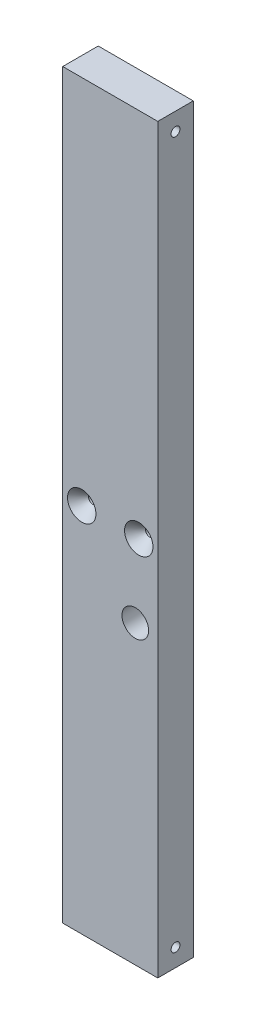
ISO-10303-21;
HEADER;
FILE_DESCRIPTION(('STEP AP214'),'2;1');
FILE_NAME('part.step','',(''),(''),'','','');
FILE_SCHEMA(('AUTOMOTIVE_DESIGN { 1 0 10303 214 1 1 1 1 }'));
ENDSEC;
DATA;
#1=APPLICATION_CONTEXT('core data for automotive mechanical design processes');
#2=APPLICATION_PROTOCOL_DEFINITION('international standard','automotive_design',2000,#1);
#3=PRODUCT_CONTEXT('',#1,'mechanical');
#4=PRODUCT('Part','Part','',(#3));
#5=PRODUCT_RELATED_PRODUCT_CATEGORY('part','',(#4));
#6=PRODUCT_DEFINITION_FORMATION('','',#4);
#7=PRODUCT_DEFINITION_CONTEXT('part definition',#1,'design');
#8=PRODUCT_DEFINITION('design','',#6,#7);
#9=PRODUCT_DEFINITION_SHAPE('','',#8);
#10=(LENGTH_UNIT() NAMED_UNIT(*) SI_UNIT(.MILLI.,.METRE.));
#11=(NAMED_UNIT(*) PLANE_ANGLE_UNIT() SI_UNIT($,.RADIAN.));
#12=(NAMED_UNIT(*) SI_UNIT($,.STERADIAN.) SOLID_ANGLE_UNIT());
#13=UNCERTAINTY_MEASURE_WITH_UNIT(LENGTH_MEASURE(1.E-05),#10,'distance_accuracy_value','');
#14=(GEOMETRIC_REPRESENTATION_CONTEXT(3) GLOBAL_UNCERTAINTY_ASSIGNED_CONTEXT((#13)) GLOBAL_UNIT_ASSIGNED_CONTEXT((#10,
#11,#12)) REPRESENTATION_CONTEXT('',''));
#15=CARTESIAN_POINT('',(0.,0.,0.));
#16=DIRECTION('',(0.,0.,1.));
#17=DIRECTION('',(1.,0.,0.));
#18=AXIS2_PLACEMENT_3D('',#15,#16,#17);
#19=CARTESIAN_POINT('',(-33.2809208496693,0.,2.22044604925031E-13));
#20=DIRECTION('',(0.,0.,1.00000000000004));
#21=DIRECTION('',(1.00000000000002,0.,0.));
#22=AXIS2_PLACEMENT_3D('',#19,#20,#21);
#23=CYLINDRICAL_SURFACE('',#22,1.5875);
#24=CARTESIAN_POINT('',(-33.2809208496694,0.,-4.01766166221915));
#25=DIRECTION('',(0.,0.,1.00000000000004));
#26=DIRECTION('',(1.00000000000002,0.,0.));
#27=AXIS2_PLACEMENT_3D('',#24,#25,#26);
#28=CIRCLE('',#27,1.58750000000001);
#29=CARTESIAN_POINT('',(-31.6934208496694,0.,-4.01766166221915));
#30=VERTEX_POINT('',#29);
#31=EDGE_CURVE('E143',#30,#30,#28,.T.);
#32=ORIENTED_EDGE('',*,*,#31,.T.);
#33=EDGE_LOOP('',(#32));
#34=FACE_BOUND('',#33,.T.);
#35=CARTESIAN_POINT('',(-33.2809208496706,0.,-6.3499999999998));
#36=DIRECTION('',(0.70710678118656,0.,0.707106781186575));
#37=DIRECTION('',(-0.707106781186559,0.,0.707106781186577));
#38=AXIS2_PLACEMENT_3D('',#35,#36,#37);
#39=ELLIPSE('',#38,2.24506403026729,1.5875);
#40=CARTESIAN_POINT('',(-33.28092084967,-1.58750000000005,-6.34999999999974));
#41=VERTEX_POINT('',#40);
#42=CARTESIAN_POINT('',(-33.280920849671,1.58749999999995,-6.34999999999986));
#43=VERTEX_POINT('',#42);
#44=EDGE_CURVE('E54',#41,#43,#39,.F.);
#45=ORIENTED_EDGE('',*,*,#44,.T.);
#46=CARTESIAN_POINT('',(-33.2809208496706,0.,-6.3499999999998));
#47=DIRECTION('',(-0.707106781186559,0.,0.707106781186577));
#48=DIRECTION('',(0.70710678118656,0.,0.707106781186575));
#49=AXIS2_PLACEMENT_3D('',#46,#47,#48);
#50=ELLIPSE('',#49,2.24506403026729,1.5875);
#51=EDGE_CURVE('E11',#43,#41,#50,.F.);
#52=ORIENTED_EDGE('',*,*,#51,.T.);
#53=EDGE_LOOP('',(#45,#52));
#54=FACE_BOUND('',#53,.T.);
#55=ADVANCED_FACE('F40',(#34,#54),#23,.F.);
#56=CARTESIAN_POINT('',(-40.0809208496699,-132.699999993998,-12.7));
#57=DIRECTION('',(-1.00000000000002,0.,0.));
#58=DIRECTION('',(0.,-1.,0.));
#59=AXIS2_PLACEMENT_3D('',#56,#57,#58);
#60=PLANE('',#59);
#61=CARTESIAN_POINT('',(-40.0809208496712,-94.5999999939987,-6.35000000000061));
#62=DIRECTION('',(-1.00000000000002,0.,0.));
#63=DIRECTION('',(0.,-1.,0.));
#64=AXIS2_PLACEMENT_3D('',#61,#62,#63);
#65=CIRCLE('',#64,1.5875);
#66=CARTESIAN_POINT('',(-40.0809208496712,-96.1874999939987,-6.35000000000061));
#67=VERTEX_POINT('',#66);
#68=EDGE_CURVE('E44',#67,#67,#65,.T.);
#69=ORIENTED_EDGE('',*,*,#68,.F.);
#70=EDGE_LOOP('',(#69));
#71=FACE_BOUND('',#70,.T.);
#72=CARTESIAN_POINT('',(-40.0809208496712,-1.10910127773849E-13,-6.35000000000035));
#73=DIRECTION('',(-1.00000000000002,0.,0.));
#74=DIRECTION('',(0.,-1.,0.));
#75=AXIS2_PLACEMENT_3D('',#72,#73,#74);
#76=CIRCLE('',#75,1.5875);
#77=CARTESIAN_POINT('',(-40.0809208496712,-1.58750000000011,-6.35000000000035));
#78=VERTEX_POINT('',#77);
#79=EDGE_CURVE('E126',#78,#78,#76,.T.);
#80=ORIENTED_EDGE('',*,*,#79,.F.);
#81=EDGE_LOOP('',(#80));
#82=FACE_BOUND('',#81,.T.);
#83=CARTESIAN_POINT('',(-40.0809208496692,94.5999999940015,-6.35000000000033));
#84=DIRECTION('',(-1.00000000000002,0.,0.));
#85=DIRECTION('',(0.,-1.,0.));
#86=AXIS2_PLACEMENT_3D('',#83,#84,#85);
#87=CIRCLE('',#86,1.5875);
#88=CARTESIAN_POINT('',(-40.0809208496692,93.0124999940014,-6.35000000000033));
#89=VERTEX_POINT('',#88);
#90=EDGE_CURVE('E132',#89,#89,#87,.T.);
#91=ORIENTED_EDGE('',*,*,#90,.F.);
#92=EDGE_LOOP('',(#91));
#93=FACE_BOUND('',#92,.T.);
#94=DIRECTION('',(0.,-1.,0.));
#95=VECTOR('',#94,1.);
#96=CARTESIAN_POINT('',(-40.0809208496701,-132.699999993998,-4.71844785465692E-13));
#97=LINE('',#96,#95);
#98=CARTESIAN_POINT('',(-40.0809208496717,132.699999994002,-7.21644966006352E-13));
#99=VERTEX_POINT('',#98);
#100=CARTESIAN_POINT('',(-40.0809208496701,-132.699999993998,-4.71844785465692E-13));
#101=VERTEX_POINT('',#100);
#102=EDGE_CURVE('E161',#99,#101,#97,.T.);
#103=ORIENTED_EDGE('',*,*,#102,.F.);
#104=DIRECTION('',(0.,0.,1.00000000000004));
#105=VECTOR('',#104,1.);
#106=CARTESIAN_POINT('',(-40.0809208496698,132.699999994002,-12.7000000000001));
#107=LINE('',#106,#105);
#108=CARTESIAN_POINT('',(-40.0809208496698,132.699999994002,-12.7000000000001));
#109=VERTEX_POINT('',#108);
#110=EDGE_CURVE('E63',#109,#99,#107,.T.);
#111=ORIENTED_EDGE('',*,*,#110,.F.);
#112=DIRECTION('',(0.,-1.,0.));
#113=VECTOR('',#112,1.);
#114=CARTESIAN_POINT('',(-40.0809208496699,-132.699999993998,-12.7));
#115=LINE('',#114,#113);
#116=CARTESIAN_POINT('',(-40.0809208496699,-132.699999993998,-12.7));
#117=VERTEX_POINT('',#116);
#118=EDGE_CURVE('E162',#109,#117,#115,.T.);
#119=ORIENTED_EDGE('',*,*,#118,.T.);
#120=DIRECTION('',(0.,0.,1.00000000000004));
#121=VECTOR('',#120,1.);
#122=CARTESIAN_POINT('',(-40.0809208496699,-132.699999993998,-12.7));
#123=LINE('',#122,#121);
#124=EDGE_CURVE('E89',#117,#101,#123,.T.);
#125=ORIENTED_EDGE('',*,*,#124,.T.);
#126=EDGE_LOOP('',(#103,#111,#119,#125));
#127=FACE_BOUND('',#126,.T.);
#128=ADVANCED_FACE('F42',(#71,#82,#93,#127),#60,.T.);
#129=CARTESIAN_POINT('',(-40.0809208496698,132.699999994002,-12.7000000000001));
#130=DIRECTION('',(0.,1.,0.));
#131=DIRECTION('',(0.,0.,1.00000000000004));
#132=AXIS2_PLACEMENT_3D('',#129,#130,#131);
#133=PLANE('',#132);
#134=DIRECTION('',(-1.00000000000002,0.,0.));
#135=VECTOR('',#134,1.);
#136=CARTESIAN_POINT('',(-40.0809208496717,132.699999994002,-7.21644966006352E-13));
#137=LINE('',#136,#135);
#138=CARTESIAN_POINT('',(-6.08092084967116,132.699999994002,4.71844785465692E-13));
#139=VERTEX_POINT('',#138);
#140=EDGE_CURVE('E165',#139,#99,#137,.T.);
#141=ORIENTED_EDGE('',*,*,#140,.F.);
#142=DIRECTION('',(0.,0.,1.00000000000004));
#143=VECTOR('',#142,1.);
#144=CARTESIAN_POINT('',(-6.08092084966935,132.699999994002,-12.7000000000005));
#145=LINE('',#144,#143);
#146=CARTESIAN_POINT('',(-6.08092084966935,132.699999994002,-12.7000000000005));
#147=VERTEX_POINT('',#146);
#148=EDGE_CURVE('E183',#147,#139,#145,.T.);
#149=ORIENTED_EDGE('',*,*,#148,.F.);
#150=DIRECTION('',(-1.00000000000002,0.,0.));
#151=VECTOR('',#150,1.);
#152=CARTESIAN_POINT('',(-40.0809208496698,132.699999994002,-12.7000000000001));
#153=LINE('',#152,#151);
#154=EDGE_CURVE('E170',#147,#109,#153,.T.);
#155=ORIENTED_EDGE('',*,*,#154,.T.);
#156=ORIENTED_EDGE('',*,*,#110,.T.);
#157=EDGE_LOOP('',(#141,#149,#155,#156));
#158=FACE_BOUND('',#157,.T.);
#159=ADVANCED_FACE('F217',(#158),#133,.T.);
#160=CARTESIAN_POINT('',(-6.08092084966941,-132.699999993998,-12.7000000000005));
#161=DIRECTION('',(1.00000000000002,0.,0.));
#162=DIRECTION('',(0.,1.,0.));
#163=AXIS2_PLACEMENT_3D('',#160,#161,#162);
#164=PLANE('',#163);
#165=CARTESIAN_POINT('',(-6.08092084967085,-126.349999993998,-6.349999999999));
#166=DIRECTION('',(1.00000000000002,0.,0.));
#167=DIRECTION('',(0.,1.,0.));
#168=AXIS2_PLACEMENT_3D('',#165,#166,#167);
#169=CIRCLE('',#168,1.5875);
#170=CARTESIAN_POINT('',(-6.08092084967085,-124.762499993998,-6.349999999999));
#171=VERTEX_POINT('',#170);
#172=EDGE_CURVE('E150',#171,#171,#169,.T.);
#173=ORIENTED_EDGE('',*,*,#172,.F.);
#174=EDGE_LOOP('',(#173));
#175=FACE_BOUND('',#174,.T.);
#176=CARTESIAN_POINT('',(-6.08092084967024,126.349999994003,-6.34999999999936));
#177=DIRECTION('',(1.00000000000002,0.,0.));
#178=DIRECTION('',(0.,1.,0.));
#179=AXIS2_PLACEMENT_3D('',#176,#177,#178);
#180=CIRCLE('',#179,1.58749999999999);
#181=CARTESIAN_POINT('',(-6.08092084967024,127.937499994003,-6.34999999999936));
#182=VERTEX_POINT('',#181);
#183=EDGE_CURVE('E154',#182,#182,#180,.T.);
#184=ORIENTED_EDGE('',*,*,#183,.F.);
#185=EDGE_LOOP('',(#184));
#186=FACE_BOUND('',#185,.T.);
#187=DIRECTION('',(0.,1.,0.));
#188=VECTOR('',#187,1.);
#189=CARTESIAN_POINT('',(-6.08092084966869,-132.699999993998,0.));
#190=LINE('',#189,#188);
#191=CARTESIAN_POINT('',(-6.08092084966869,-132.699999993998,0.));
#192=VERTEX_POINT('',#191);
#193=EDGE_CURVE('E177',#192,#139,#190,.T.);
#194=ORIENTED_EDGE('',*,*,#193,.F.);
#195=DIRECTION('',(0.,0.,1.00000000000004));
#196=VECTOR('',#195,1.);
#197=CARTESIAN_POINT('',(-6.08092084966941,-132.699999993998,-12.7000000000005));
#198=LINE('',#197,#196);
#199=CARTESIAN_POINT('',(-6.08092084966941,-132.699999993998,-12.7000000000005));
#200=VERTEX_POINT('',#199);
#201=EDGE_CURVE('E185',#200,#192,#198,.T.);
#202=ORIENTED_EDGE('',*,*,#201,.F.);
#203=DIRECTION('',(0.,1.,0.));
#204=VECTOR('',#203,1.);
#205=CARTESIAN_POINT('',(-6.08092084966941,-132.699999993998,-12.7000000000005));
#206=LINE('',#205,#204);
#207=EDGE_CURVE('E167',#200,#147,#206,.T.);
#208=ORIENTED_EDGE('',*,*,#207,.T.);
#209=ORIENTED_EDGE('',*,*,#148,.T.);
#210=EDGE_LOOP('',(#194,#202,#208,#209));
#211=FACE_BOUND('',#210,.T.);
#212=ADVANCED_FACE('F262',(#175,#186,#211),#164,.T.);
#213=CARTESIAN_POINT('',(-40.0809208496699,-132.699999993998,-12.7));
#214=DIRECTION('',(0.,-1.,0.));
#215=DIRECTION('',(1.00000000000002,0.,0.));
#216=AXIS2_PLACEMENT_3D('',#213,#214,#215);
#217=PLANE('',#216);
#218=DIRECTION('',(1.00000000000002,0.,0.));
#219=VECTOR('',#218,1.);
#220=CARTESIAN_POINT('',(-40.0809208496701,-132.699999993998,-4.71844785465692E-13));
#221=LINE('',#220,#219);
#222=EDGE_CURVE('E174',#101,#192,#221,.T.);
#223=ORIENTED_EDGE('',*,*,#222,.F.);
#224=ORIENTED_EDGE('',*,*,#124,.F.);
#225=DIRECTION('',(1.00000000000002,0.,0.));
#226=VECTOR('',#225,1.);
#227=CARTESIAN_POINT('',(-40.0809208496699,-132.699999993998,-12.7));
#228=LINE('',#227,#226);
#229=EDGE_CURVE('E164',#117,#200,#228,.T.);
#230=ORIENTED_EDGE('',*,*,#229,.T.);
#231=ORIENTED_EDGE('',*,*,#201,.T.);
#232=EDGE_LOOP('',(#223,#224,#230,#231));
#233=FACE_BOUND('',#232,.T.);
#234=ADVANCED_FACE('F255',(#233),#217,.T.);
#235=CARTESIAN_POINT('',(-4.9960036108132E-13,0.,-12.7));
#236=DIRECTION('',(0.,0.,-1.00000000000004));
#237=DIRECTION('',(-1.00000000000002,0.,0.));
#238=AXIS2_PLACEMENT_3D('',#235,#236,#237);
#239=PLANE('',#238);
#240=CARTESIAN_POINT('',(-12.8809208496695,0.,-12.6999999999999));
#241=DIRECTION('',(0.,0.,-1.00000000000004));
#242=DIRECTION('',(-1.00000000000002,0.,0.));
#243=AXIS2_PLACEMENT_3D('',#240,#241,#242);
#244=CIRCLE('',#243,1.5875);
#245=CARTESIAN_POINT('',(-14.4684208496695,0.,-12.6999999999999));
#246=VERTEX_POINT('',#245);
#247=EDGE_CURVE('E139',#246,#246,#244,.T.);
#248=ORIENTED_EDGE('',*,*,#247,.F.);
#249=EDGE_LOOP('',(#248));
#250=FACE_BOUND('',#249,.T.);
#251=CARTESIAN_POINT('',(-33.2809208496698,0.,-12.700000000001));
#252=DIRECTION('',(0.,0.,-1.00000000000004));
#253=DIRECTION('',(-1.00000000000002,0.,0.));
#254=AXIS2_PLACEMENT_3D('',#251,#252,#253);
#255=CIRCLE('',#254,1.5875);
#256=CARTESIAN_POINT('',(-34.8684208496698,0.,-12.700000000001));
#257=VERTEX_POINT('',#256);
#258=EDGE_CURVE('E146',#257,#257,#255,.T.);
#259=ORIENTED_EDGE('',*,*,#258,.F.);
#260=EDGE_LOOP('',(#259));
#261=FACE_BOUND('',#260,.T.);
#262=CARTESIAN_POINT('',(-14.1180054889134,-26.7326540448634,-12.6999999999992));
#263=DIRECTION('',(0.,0.,1.00000000000004));
#264=DIRECTION('',(1.00000000000002,0.,0.));
#265=AXIS2_PLACEMENT_3D('',#262,#263,#264);
#266=CIRCLE('',#265,4.7625);
#267=CARTESIAN_POINT('',(-9.35550548891335,-26.7326540448634,-12.6999999999992));
#268=VERTEX_POINT('',#267);
#269=EDGE_CURVE('E158',#268,#268,#266,.T.);
#270=ORIENTED_EDGE('',*,*,#269,.T.);
#271=EDGE_LOOP('',(#270));
#272=FACE_BOUND('',#271,.T.);
#273=ORIENTED_EDGE('',*,*,#118,.F.);
#274=ORIENTED_EDGE('',*,*,#154,.F.);
#275=ORIENTED_EDGE('',*,*,#207,.F.);
#276=ORIENTED_EDGE('',*,*,#229,.F.);
#277=EDGE_LOOP('',(#273,#274,#275,#276));
#278=FACE_BOUND('',#277,.T.);
#279=ADVANCED_FACE('F252',(#250,#261,#272,#278),#239,.T.);
#280=CARTESIAN_POINT('',(0.,0.,0.));
#281=DIRECTION('',(0.,0.,-1.00000000000004));
#282=DIRECTION('',(-1.00000000000002,0.,0.));
#283=AXIS2_PLACEMENT_3D('',#280,#281,#282);
#284=PLANE('',#283);
#285=CARTESIAN_POINT('',(-12.8809208496706,0.,-1.02695629777827E-12));
#286=DIRECTION('',(0.,0.,1.00000000000004));
#287=DIRECTION('',(1.00000000000002,0.,0.));
#288=AXIS2_PLACEMENT_3D('',#285,#286,#287);
#289=CIRCLE('',#288,5.08);
#290=CARTESIAN_POINT('',(-7.80092084967049,0.,-1.02625130615763E-12));
#291=VERTEX_POINT('',#290);
#292=EDGE_CURVE('E133',#291,#291,#289,.T.);
#293=ORIENTED_EDGE('',*,*,#292,.F.);
#294=EDGE_LOOP('',(#293));
#295=FACE_BOUND('',#294,.T.);
#296=CARTESIAN_POINT('',(-33.2809208496693,0.,2.22044604925031E-13));
#297=DIRECTION('',(0.,0.,1.00000000000004));
#298=DIRECTION('',(1.00000000000002,0.,0.));
#299=AXIS2_PLACEMENT_3D('',#296,#297,#298);
#300=CIRCLE('',#299,5.08);
#301=CARTESIAN_POINT('',(-28.2009208496692,0.,2.22749596545668E-13));
#302=VERTEX_POINT('',#301);
#303=EDGE_CURVE('E140',#302,#302,#300,.T.);
#304=ORIENTED_EDGE('',*,*,#303,.F.);
#305=EDGE_LOOP('',(#304));
#306=FACE_BOUND('',#305,.T.);
#307=CARTESIAN_POINT('',(-14.1180054889123,-26.7326540448637,0.));
#308=DIRECTION('',(0.,0.,1.00000000000004));
#309=DIRECTION('',(1.00000000000002,0.,0.));
#310=AXIS2_PLACEMENT_3D('',#307,#308,#309);
#311=CIRCLE('',#310,4.7625);
#312=CARTESIAN_POINT('',(-9.35550548891221,-26.7326540448637,0.));
#313=VERTEX_POINT('',#312);
#314=EDGE_CURVE('E155',#313,#313,#311,.T.);
#315=ORIENTED_EDGE('',*,*,#314,.F.);
#316=EDGE_LOOP('',(#315));
#317=FACE_BOUND('',#316,.T.);
#318=ORIENTED_EDGE('',*,*,#102,.T.);
#319=ORIENTED_EDGE('',*,*,#222,.T.);
#320=ORIENTED_EDGE('',*,*,#193,.T.);
#321=ORIENTED_EDGE('',*,*,#140,.T.);
#322=EDGE_LOOP('',(#318,#319,#320,#321));
#323=FACE_BOUND('',#322,.T.);
#324=ADVANCED_FACE('F250',(#295,#306,#317,#323),#284,.F.);
#325=CARTESIAN_POINT('',(-14.1180054889123,-26.7326540448637,0.));
#326=DIRECTION('',(0.,0.,1.00000000000004));
#327=DIRECTION('',(1.00000000000002,0.,0.));
#328=AXIS2_PLACEMENT_3D('',#325,#326,#327);
#329=CYLINDRICAL_SURFACE('',#328,4.7625);
#330=ORIENTED_EDGE('',*,*,#269,.F.);
#331=EDGE_LOOP('',(#330));
#332=FACE_BOUND('',#331,.T.);
#333=ORIENTED_EDGE('',*,*,#314,.T.);
#334=EDGE_LOOP('',(#333));
#335=FACE_BOUND('',#334,.T.);
#336=ADVANCED_FACE('F246',(#332,#335),#329,.F.);
#337=CARTESIAN_POINT('',(-18.8309208496703,126.349999994003,-6.34999999999966));
#338=DIRECTION('',(1.00000000000002,0.,0.));
#339=DIRECTION('',(0.,0.,-1.00000000000005));
#340=AXIS2_PLACEMENT_3D('',#337,#338,#339);
#341=CONICAL_SURFACE('',#340,1.58749999999999,1.02974425867665);
#342=CARTESIAN_POINT('',(-19.7847870823767,126.349999994003,-6.34999999999963));
#343=VERTEX_POINT('',#342);
#344=VERTEX_LOOP('',#343);
#345=FACE_BOUND('',#344,.T.);
#346=CARTESIAN_POINT('',(-18.8309208496703,126.349999994003,-6.34999999999966));
#347=DIRECTION('',(1.00000000000002,0.,0.));
#348=DIRECTION('',(0.,0.,-1.00000000000005));
#349=AXIS2_PLACEMENT_3D('',#346,#347,#348);
#350=CIRCLE('',#349,1.58749999999999);
#351=CARTESIAN_POINT('',(-18.8309208496703,126.349999994003,-7.93749999999973));
#352=VERTEX_POINT('',#351);
#353=EDGE_CURVE('E151',#352,#352,#350,.T.);
#354=ORIENTED_EDGE('',*,*,#353,.T.);
#355=EDGE_LOOP('',(#354));
#356=FACE_BOUND('',#355,.T.);
#357=ADVANCED_FACE('F242',(#345,#356),#341,.F.);
#358=CARTESIAN_POINT('',(12.9190791503291,126.349999994003,-6.34999999999916));
#359=DIRECTION('',(1.00000000000002,0.,0.));
#360=DIRECTION('',(0.,0.,-1.00000000000005));
#361=AXIS2_PLACEMENT_3D('',#358,#359,#360);
#362=CYLINDRICAL_SURFACE('',#361,1.58749999999999);
#363=ORIENTED_EDGE('',*,*,#183,.T.);
#364=EDGE_LOOP('',(#363));
#365=FACE_BOUND('',#364,.T.);
#366=ORIENTED_EDGE('',*,*,#353,.F.);
#367=EDGE_LOOP('',(#366));
#368=FACE_BOUND('',#367,.T.);
#369=ADVANCED_FACE('F235',(#365,#368),#362,.F.);
#370=CARTESIAN_POINT('',(-18.830920849669,-126.349999993998,-6.34999999999947));
#371=DIRECTION('',(1.00000000000002,0.,0.));
#372=DIRECTION('',(0.,0.,-1.00000000000005));
#373=AXIS2_PLACEMENT_3D('',#370,#371,#372);
#374=CONICAL_SURFACE('',#373,1.58749999999999,1.02974425867665);
#375=CARTESIAN_POINT('',(-19.7847870823752,-126.349999993998,-6.34999999999986));
#376=VERTEX_POINT('',#375);
#377=VERTEX_LOOP('',#376);
#378=FACE_BOUND('',#377,.T.);
#379=CARTESIAN_POINT('',(-18.830920849669,-126.349999993998,-6.34999999999947));
#380=DIRECTION('',(1.00000000000002,0.,0.));
#381=DIRECTION('',(0.,0.,-1.00000000000005));
#382=AXIS2_PLACEMENT_3D('',#379,#380,#381);
#383=CIRCLE('',#382,1.58749999999999);
#384=CARTESIAN_POINT('',(-18.830920849669,-126.349999993998,-7.93749999999953));
#385=VERTEX_POINT('',#384);
#386=EDGE_CURVE('E147',#385,#385,#383,.T.);
#387=ORIENTED_EDGE('',*,*,#386,.T.);
#388=EDGE_LOOP('',(#387));
#389=FACE_BOUND('',#388,.T.);
#390=ADVANCED_FACE('F230',(#378,#389),#374,.F.);
#391=CARTESIAN_POINT('',(12.9190791503306,-126.349999993998,-6.34999999999941));
#392=DIRECTION('',(1.00000000000002,0.,0.));
#393=DIRECTION('',(0.,0.,-1.00000000000005));
#394=AXIS2_PLACEMENT_3D('',#391,#392,#393);
#395=CYLINDRICAL_SURFACE('',#394,1.5875);
#396=ORIENTED_EDGE('',*,*,#172,.T.);
#397=EDGE_LOOP('',(#396));
#398=FACE_BOUND('',#397,.T.);
#399=ORIENTED_EDGE('',*,*,#386,.F.);
#400=EDGE_LOOP('',(#399));
#401=FACE_BOUND('',#400,.T.);
#402=ADVANCED_FACE('F223',(#398,#401),#395,.F.);
#403=CARTESIAN_POINT('',(-33.2809208496706,0.,-6.3499999999998));
#404=DIRECTION('',(0.70710678118656,0.,0.707106781186575));
#405=DIRECTION('',(-0.707106781186559,0.,0.707106781186577));
#406=AXIS2_PLACEMENT_3D('',#403,#404,#405);
#407=ELLIPSE('',#406,2.24506403026729,1.5875);
#408=EDGE_CURVE('E199',#41,#43,#407,.T.);
#409=ORIENTED_EDGE('',*,*,#408,.T.);
#410=CARTESIAN_POINT('',(-33.2809208496706,0.,-6.3499999999998));
#411=DIRECTION('',(-0.707106781186559,0.,0.707106781186577));
#412=DIRECTION('',(0.70710678118656,0.,0.707106781186575));
#413=AXIS2_PLACEMENT_3D('',#410,#411,#412);
#414=ELLIPSE('',#413,2.24506403026729,1.5875);
#415=EDGE_CURVE('E49',#43,#41,#414,.T.);
#416=ORIENTED_EDGE('',*,*,#415,.T.);
#417=EDGE_LOOP('',(#409,#416));
#418=FACE_BOUND('',#417,.T.);
#419=ORIENTED_EDGE('',*,*,#258,.T.);
#420=EDGE_LOOP('',(#419));
#421=FACE_BOUND('',#420,.T.);
#422=ADVANCED_FACE('F204',(#418,#421),#23,.F.);
#423=CARTESIAN_POINT('',(-33.2809208496693,0.,2.22044604925031E-13));
#424=DIRECTION('',(0.,0.,1.00000000000004));
#425=DIRECTION('',(1.00000000000002,0.,0.));
#426=AXIS2_PLACEMENT_3D('',#423,#424,#425);
#427=CONICAL_SURFACE('',#426,5.08,0.715584993317676);
#428=ORIENTED_EDGE('',*,*,#31,.F.);
#429=EDGE_LOOP('',(#428));
#430=FACE_BOUND('',#429,.T.);
#431=ORIENTED_EDGE('',*,*,#303,.T.);
#432=EDGE_LOOP('',(#431));
#433=FACE_BOUND('',#432,.T.);
#434=ADVANCED_FACE('F222',(#430,#433),#427,.F.);
#435=CARTESIAN_POINT('',(-12.8809208496693,0.,-4.44089209850063E-13));
#436=DIRECTION('',(0.,0.,1.00000000000004));
#437=DIRECTION('',(1.00000000000002,0.,0.));
#438=AXIS2_PLACEMENT_3D('',#435,#436,#437);
#439=CYLINDRICAL_SURFACE('',#438,1.5875);
#440=ORIENTED_EDGE('',*,*,#247,.T.);
#441=EDGE_LOOP('',(#440));
#442=FACE_BOUND('',#441,.T.);
#443=CARTESIAN_POINT('',(-12.8809208496692,0.,-4.01766166221856));
#444=DIRECTION('',(0.,0.,1.00000000000004));
#445=DIRECTION('',(1.00000000000002,0.,0.));
#446=AXIS2_PLACEMENT_3D('',#443,#444,#445);
#447=CIRCLE('',#446,1.5875);
#448=CARTESIAN_POINT('',(-11.2934208496692,0.,-4.01766166221856));
#449=VERTEX_POINT('',#448);
#450=EDGE_CURVE('E136',#449,#449,#447,.T.);
#451=ORIENTED_EDGE('',*,*,#450,.T.);
#452=EDGE_LOOP('',(#451));
#453=FACE_BOUND('',#452,.T.);
#454=ADVANCED_FACE('F228',(#442,#453),#439,.F.);
#455=CARTESIAN_POINT('',(-12.8809208496706,0.,-1.02695629777827E-12));
#456=DIRECTION('',(0.,0.,1.00000000000004));
#457=DIRECTION('',(1.00000000000002,0.,0.));
#458=AXIS2_PLACEMENT_3D('',#455,#456,#457);
#459=CONICAL_SURFACE('',#458,5.08,0.715584993317677);
#460=ORIENTED_EDGE('',*,*,#450,.F.);
#461=EDGE_LOOP('',(#460));
#462=FACE_BOUND('',#461,.T.);
#463=ORIENTED_EDGE('',*,*,#292,.T.);
#464=EDGE_LOOP('',(#463));
#465=FACE_BOUND('',#464,.T.);
#466=ADVANCED_FACE('F315',(#462,#465),#459,.F.);
#467=CARTESIAN_POINT('',(-21.0309208496689,94.5999999940027,-6.34999999999997));
#468=DIRECTION('',(-1.00000000000002,0.,0.));
#469=DIRECTION('',(0.,0.,1.00000000000005));
#470=AXIS2_PLACEMENT_3D('',#467,#468,#469);
#471=CONICAL_SURFACE('',#470,1.58749999999999,1.02974425867665);
#472=CARTESIAN_POINT('',(-20.0770546169626,94.5999999940028,-6.34999999999997));
#473=VERTEX_POINT('',#472);
#474=VERTEX_LOOP('',#473);
#475=FACE_BOUND('',#474,.T.);
#476=CARTESIAN_POINT('',(-21.0309208496689,94.5999999940027,-6.34999999999997));
#477=DIRECTION('',(-1.00000000000002,0.,0.));
#478=DIRECTION('',(0.,0.,1.00000000000005));
#479=AXIS2_PLACEMENT_3D('',#476,#477,#478);
#480=CIRCLE('',#479,1.58749999999999);
#481=CARTESIAN_POINT('',(-21.0309208496689,94.5999999940027,-4.7624999999999));
#482=VERTEX_POINT('',#481);
#483=EDGE_CURVE('E129',#482,#482,#480,.T.);
#484=ORIENTED_EDGE('',*,*,#483,.T.);
#485=EDGE_LOOP('',(#484));
#486=FACE_BOUND('',#485,.T.);
#487=ADVANCED_FACE('F322',(#475,#486),#471,.F.);
#488=CARTESIAN_POINT('',(-52.7809208496694,94.5999999940014,-6.3500000000003));
#489=DIRECTION('',(-1.00000000000002,0.,0.));
#490=DIRECTION('',(0.,0.,1.00000000000005));
#491=AXIS2_PLACEMENT_3D('',#488,#489,#490);
#492=CYLINDRICAL_SURFACE('',#491,1.5875);
#493=ORIENTED_EDGE('',*,*,#90,.T.);
#494=EDGE_LOOP('',(#493));
#495=FACE_BOUND('',#494,.T.);
#496=ORIENTED_EDGE('',*,*,#483,.F.);
#497=EDGE_LOOP('',(#496));
#498=FACE_BOUND('',#497,.T.);
#499=ADVANCED_FACE('F333',(#495,#498),#492,.F.);
#500=CARTESIAN_POINT('',(-52.7809208496696,0.,-6.34999999999916));
#501=DIRECTION('',(-1.00000000000002,0.,0.));
#502=DIRECTION('',(0.,0.,1.00000000000005));
#503=AXIS2_PLACEMENT_3D('',#500,#501,#502);
#504=CYLINDRICAL_SURFACE('',#503,1.5875);
#505=ORIENTED_EDGE('',*,*,#79,.T.);
#506=EDGE_LOOP('',(#505));
#507=FACE_BOUND('',#506,.T.);
#508=ORIENTED_EDGE('',*,*,#44,.F.);
#509=ORIENTED_EDGE('',*,*,#415,.F.);
#510=EDGE_LOOP('',(#508,#509));
#511=FACE_BOUND('',#510,.T.);
#512=ADVANCED_FACE('F208',(#507,#511),#504,.F.);
#513=CARTESIAN_POINT('',(-21.0309208496696,0.,-6.34999999999938));
#514=DIRECTION('',(-1.00000000000002,0.,0.));
#515=DIRECTION('',(0.,0.,1.00000000000005));
#516=AXIS2_PLACEMENT_3D('',#513,#514,#515);
#517=CIRCLE('',#516,1.5875);
#518=CARTESIAN_POINT('',(-21.0309208496696,0.,-4.76249999999931));
#519=VERTEX_POINT('',#518);
#520=EDGE_CURVE('E122',#519,#519,#517,.T.);
#521=ORIENTED_EDGE('',*,*,#520,.F.);
#522=EDGE_LOOP('',(#521));
#523=FACE_BOUND('',#522,.T.);
#524=ORIENTED_EDGE('',*,*,#408,.F.);
#525=ORIENTED_EDGE('',*,*,#51,.F.);
#526=EDGE_LOOP('',(#524,#525));
#527=FACE_BOUND('',#526,.T.);
#528=ADVANCED_FACE('F210',(#523,#527),#504,.F.);
#529=CARTESIAN_POINT('',(-21.0309208496696,0.,-6.34999999999938));
#530=DIRECTION('',(-1.00000000000002,0.,0.));
#531=DIRECTION('',(0.,0.,1.00000000000005));
#532=AXIS2_PLACEMENT_3D('',#529,#530,#531);
#533=CONICAL_SURFACE('',#532,1.5875,1.02974425867666);
#534=CARTESIAN_POINT('',(-20.0770546169638,0.,-6.34999999999944));
#535=VERTEX_POINT('',#534);
#536=VERTEX_LOOP('',#535);
#537=FACE_BOUND('',#536,.T.);
#538=ORIENTED_EDGE('',*,*,#520,.T.);
#539=EDGE_LOOP('',(#538));
#540=FACE_BOUND('',#539,.T.);
#541=ADVANCED_FACE('F114',(#537,#540),#533,.F.);
#542=CARTESIAN_POINT('',(-21.0309208496709,-94.5999999939975,-6.3499999999995));
#543=DIRECTION('',(-1.00000000000002,0.,0.));
#544=DIRECTION('',(0.,0.,1.00000000000005));
#545=AXIS2_PLACEMENT_3D('',#542,#543,#544);
#546=CONICAL_SURFACE('',#545,1.58749999999999,1.02974425867665);
#547=CARTESIAN_POINT('',(-20.0770546169637,-94.5999999939975,-6.34999999999941));
#548=VERTEX_POINT('',#547);
#549=VERTEX_LOOP('',#548);
#550=FACE_BOUND('',#549,.T.);
#551=CARTESIAN_POINT('',(-21.0309208496709,-94.5999999939975,-6.3499999999995));
#552=DIRECTION('',(-1.00000000000002,0.,0.));
#553=DIRECTION('',(0.,0.,1.00000000000005));
#554=AXIS2_PLACEMENT_3D('',#551,#552,#553);
#555=CIRCLE('',#554,1.58749999999999);
#556=CARTESIAN_POINT('',(-21.0309208496709,-94.5999999939975,-4.76249999999943));
#557=VERTEX_POINT('',#556);
#558=EDGE_CURVE('E118',#557,#557,#555,.T.);
#559=ORIENTED_EDGE('',*,*,#558,.T.);
#560=EDGE_LOOP('',(#559));
#561=FACE_BOUND('',#560,.T.);
#562=ADVANCED_FACE('F110',(#550,#561),#546,.F.);
#563=CARTESIAN_POINT('',(-52.780920849671,-94.5999999939988,-6.34999999999927));
#564=DIRECTION('',(-1.00000000000002,0.,0.));
#565=DIRECTION('',(0.,0.,1.00000000000005));
#566=AXIS2_PLACEMENT_3D('',#563,#564,#565);
#567=CYLINDRICAL_SURFACE('',#566,1.5875);
#568=ORIENTED_EDGE('',*,*,#68,.T.);
#569=EDGE_LOOP('',(#568));
#570=FACE_BOUND('',#569,.T.);
#571=ORIENTED_EDGE('',*,*,#558,.F.);
#572=EDGE_LOOP('',(#571));
#573=FACE_BOUND('',#572,.T.);
#574=ADVANCED_FACE('F113',(#570,#573),#567,.F.);
#575=CLOSED_SHELL('',(#55,#128,#159,#212,#234,#279,#324,#336,#357,#369,#390,#402,#422,#434,#454,
#466,#487,#499,#512,#528,#541,#562,#574));
#576=MANIFOLD_SOLID_BREP('B2',#575);
#577=ADVANCED_BREP_SHAPE_REPRESENTATION('',(#18,#576),#14);
#578=SHAPE_DEFINITION_REPRESENTATION(#9,#577);
ENDSEC;
END-ISO-10303-21;
